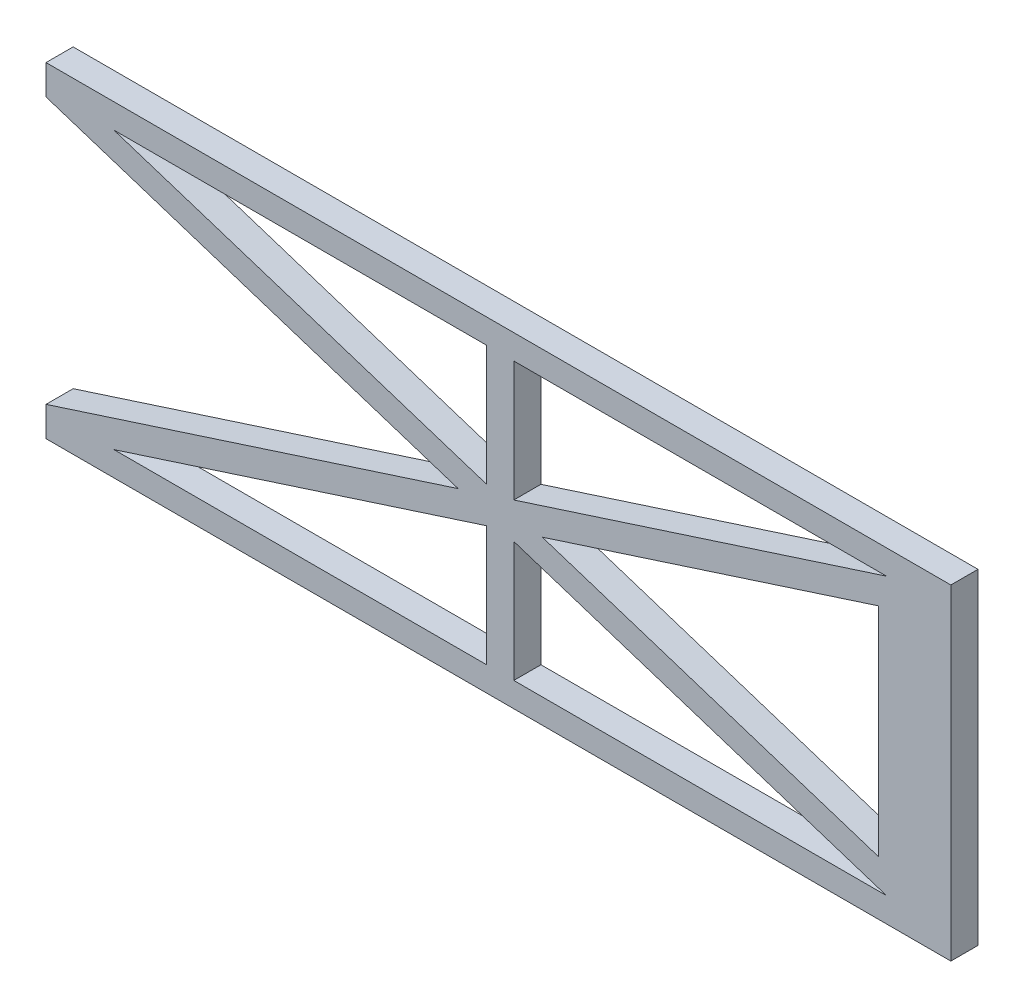
ISO-10303-21;
HEADER;
FILE_DESCRIPTION(('STEP AP214'),'2;1');
FILE_NAME('part.step','',(''),(''),'','','');
FILE_SCHEMA(('AUTOMOTIVE_DESIGN { 1 0 10303 214 1 1 1 1 }'));
ENDSEC;
DATA;
#1=APPLICATION_CONTEXT('core data for automotive mechanical design processes');
#2=APPLICATION_PROTOCOL_DEFINITION('international standard','automotive_design',2000,#1);
#3=PRODUCT_CONTEXT('',#1,'mechanical');
#4=PRODUCT('Part','Part','',(#3));
#5=PRODUCT_RELATED_PRODUCT_CATEGORY('part','',(#4));
#6=PRODUCT_DEFINITION_FORMATION('','',#4);
#7=PRODUCT_DEFINITION_CONTEXT('part definition',#1,'design');
#8=PRODUCT_DEFINITION('design','',#6,#7);
#9=PRODUCT_DEFINITION_SHAPE('','',#8);
#10=(LENGTH_UNIT() NAMED_UNIT(*) SI_UNIT(.MILLI.,.METRE.));
#11=(NAMED_UNIT(*) PLANE_ANGLE_UNIT() SI_UNIT($,.RADIAN.));
#12=(NAMED_UNIT(*) SI_UNIT($,.STERADIAN.) SOLID_ANGLE_UNIT());
#13=UNCERTAINTY_MEASURE_WITH_UNIT(LENGTH_MEASURE(1.E-05),#10,'distance_accuracy_value','');
#14=(GEOMETRIC_REPRESENTATION_CONTEXT(3) GLOBAL_UNCERTAINTY_ASSIGNED_CONTEXT((#13)) GLOBAL_UNIT_ASSIGNED_CONTEXT((#10,
#11,#12)) REPRESENTATION_CONTEXT('',''));
#15=CARTESIAN_POINT('',(0.,0.,0.));
#16=DIRECTION('',(0.,0.,1.));
#17=DIRECTION('',(1.,0.,0.));
#18=AXIS2_PLACEMENT_3D('',#15,#16,#17);
#19=CARTESIAN_POINT('',(-928.915298157078,-300.,-30.));
#20=DIRECTION('',(-0.307327428017138,0.951603831427959,0.));
#21=DIRECTION('',(-0.951603831427959,-0.307327428017138,0.));
#22=AXIS2_PLACEMENT_3D('',#19,#20,#21);
#23=PLANE('',#22);
#24=DIRECTION('',(-0.951603831427959,-0.307327428017138,0.));
#25=VECTOR('',#24,1.);
#26=CARTESIAN_POINT('',(-928.915298157078,-300.,-30.));
#27=LINE('',#26,#25);
#28=CARTESIAN_POINT('',(0.,0.,-30.));
#29=VERTEX_POINT('',#28);
#30=CARTESIAN_POINT('',(-411.927182327763,-133.034900968368,-30.));
#31=VERTEX_POINT('',#30);
#32=EDGE_CURVE('E68',#29,#31,#27,.T.);
#33=ORIENTED_EDGE('',*,*,#32,.T.);
#34=DIRECTION('',(0.,0.,1.));
#35=VECTOR('',#34,1.);
#36=CARTESIAN_POINT('',(-411.927182327763,-133.034900968368,-30.));
#37=LINE('',#36,#35);
#38=CARTESIAN_POINT('',(-411.927182327763,-133.034900968368,0.));
#39=VERTEX_POINT('',#38);
#40=EDGE_CURVE('E365',#31,#39,#37,.T.);
#41=ORIENTED_EDGE('',*,*,#40,.T.);
#42=DIRECTION('',(-0.951603831427959,-0.307327428017138,0.));
#43=VECTOR('',#42,1.);
#44=CARTESIAN_POINT('',(-928.915298157078,-300.,0.));
#45=LINE('',#44,#43);
#46=CARTESIAN_POINT('',(0.,0.,0.));
#47=VERTEX_POINT('',#46);
#48=EDGE_CURVE('E259',#47,#39,#45,.T.);
#49=ORIENTED_EDGE('',*,*,#48,.F.);
#50=DIRECTION('',(0.,0.,1.));
#51=VECTOR('',#50,1.);
#52=CARTESIAN_POINT('',(0.,0.,-30.));
#53=LINE('',#52,#51);
#54=EDGE_CURVE('E276',#29,#47,#53,.T.);
#55=ORIENTED_EDGE('',*,*,#54,.F.);
#56=EDGE_LOOP('',(#33,#41,#49,#55));
#57=FACE_BOUND('',#56,.T.);
#58=ADVANCED_FACE('F45',(#57),#23,.T.);
#59=CARTESIAN_POINT('',(0.,0.,-30.));
#60=DIRECTION('',(0.,-1.,0.));
#61=DIRECTION('',(1.,0.,0.));
#62=AXIS2_PLACEMENT_3D('',#59,#60,#61);
#63=PLANE('',#62);
#64=DIRECTION('',(1.,0.,0.));
#65=VECTOR('',#64,1.);
#66=CARTESIAN_POINT('',(0.,0.,0.));
#67=LINE('',#66,#65);
#68=CARTESIAN_POINT('',(-411.927182327763,0.,0.));
#69=VERTEX_POINT('',#68);
#70=EDGE_CURVE('E272',#69,#47,#67,.T.);
#71=ORIENTED_EDGE('',*,*,#70,.F.);
#72=DIRECTION('',(0.,0.,1.));
#73=VECTOR('',#72,1.);
#74=CARTESIAN_POINT('',(-411.927182327763,0.,0.));
#75=LINE('',#74,#73);
#76=CARTESIAN_POINT('',(-411.927182327763,0.,-30.));
#77=VERTEX_POINT('',#76);
#78=EDGE_CURVE('E373',#77,#69,#75,.T.);
#79=ORIENTED_EDGE('',*,*,#78,.F.);
#80=DIRECTION('',(1.,0.,0.));
#81=VECTOR('',#80,1.);
#82=CARTESIAN_POINT('',(0.,0.,-30.));
#83=LINE('',#82,#81);
#84=EDGE_CURVE('E256',#77,#29,#83,.T.);
#85=ORIENTED_EDGE('',*,*,#84,.T.);
#86=ORIENTED_EDGE('',*,*,#54,.T.);
#87=EDGE_LOOP('',(#71,#79,#85,#86));
#88=FACE_BOUND('',#87,.T.);
#89=ADVANCED_FACE('F413',(#88),#63,.T.);
#90=CARTESIAN_POINT('',(-853.854364655526,-1.11022302462516E-13,-30.));
#91=VERTEX_POINT('',#90);
#92=CARTESIAN_POINT('',(-441.927182327763,0.,-30.));
#93=VERTEX_POINT('',#92);
#94=EDGE_CURVE('E228',#91,#93,#83,.T.);
#95=ORIENTED_EDGE('',*,*,#94,.T.);
#96=DIRECTION('',(0.,0.,-1.));
#97=VECTOR('',#96,1.);
#98=CARTESIAN_POINT('',(-441.927182327763,0.,0.));
#99=LINE('',#98,#97);
#100=CARTESIAN_POINT('',(-441.927182327763,0.,0.));
#101=VERTEX_POINT('',#100);
#102=EDGE_CURVE('E369',#101,#93,#99,.T.);
#103=ORIENTED_EDGE('',*,*,#102,.F.);
#104=CARTESIAN_POINT('',(-853.854364655526,-1.22504029266495E-13,0.));
#105=VERTEX_POINT('',#104);
#106=EDGE_CURVE('E273',#105,#101,#67,.T.);
#107=ORIENTED_EDGE('',*,*,#106,.F.);
#108=DIRECTION('',(0.,0.,-1.));
#109=VECTOR('',#108,1.);
#110=CARTESIAN_POINT('',(-853.854364655526,-1.06230180454845E-13,-30.));
#111=LINE('',#110,#109);
#112=EDGE_CURVE('E321',#105,#91,#111,.T.);
#113=ORIENTED_EDGE('',*,*,#112,.T.);
#114=EDGE_LOOP('',(#95,#103,#107,#113));
#115=FACE_BOUND('',#114,.T.);
#116=ADVANCED_FACE('F417',(#115),#63,.T.);
#117=CARTESIAN_POINT('',(-8.91529815707796,-32.8792608458809,-30.));
#118=DIRECTION('',(0.307327428017138,-0.951603831427959,0.));
#119=DIRECTION('',(0.951603831427959,0.307327428017138,0.));
#120=AXIS2_PLACEMENT_3D('',#117,#118,#119);
#121=PLANE('',#120);
#122=DIRECTION('',(0.951603831427959,0.307327428017138,0.));
#123=VECTOR('',#122,1.);
#124=CARTESIAN_POINT('',(-8.91529815707796,-32.8792608458809,-30.));
#125=LINE('',#124,#123);
#126=CARTESIAN_POINT('',(-853.854364655526,-305.758521691762,-30.));
#127=VERTEX_POINT('',#126);
#128=CARTESIAN_POINT('',(-441.927182327763,-172.723620723394,-30.));
#129=VERTEX_POINT('',#128);
#130=EDGE_CURVE('E60',#127,#129,#125,.T.);
#131=ORIENTED_EDGE('',*,*,#130,.T.);
#132=DIRECTION('',(0.,0.,1.));
#133=VECTOR('',#132,1.);
#134=CARTESIAN_POINT('',(-441.927182327763,-172.723620723394,-30.));
#135=LINE('',#134,#133);
#136=CARTESIAN_POINT('',(-441.927182327763,-172.723620723394,0.));
#137=VERTEX_POINT('',#136);
#138=EDGE_CURVE('E367',#129,#137,#135,.T.);
#139=ORIENTED_EDGE('',*,*,#138,.T.);
#140=DIRECTION('',(0.951603831427959,0.307327428017138,0.));
#141=VECTOR('',#140,1.);
#142=CARTESIAN_POINT('',(-8.91529815707796,-32.8792608458809,0.));
#143=LINE('',#142,#141);
#144=CARTESIAN_POINT('',(-853.854364655526,-305.758521691762,0.));
#145=VERTEX_POINT('',#144);
#146=EDGE_CURVE('E215',#145,#137,#143,.T.);
#147=ORIENTED_EDGE('',*,*,#146,.F.);
#148=DIRECTION('',(0.,0.,-1.));
#149=VECTOR('',#148,1.);
#150=CARTESIAN_POINT('',(-853.854364655526,-305.758521691762,-30.));
#151=LINE('',#150,#149);
#152=EDGE_CURVE('E318',#145,#127,#151,.T.);
#153=ORIENTED_EDGE('',*,*,#152,.T.);
#154=EDGE_LOOP('',(#131,#139,#147,#153));
#155=FACE_BOUND('',#154,.T.);
#156=ADVANCED_FACE('F425',(#155),#121,.T.);
#157=CARTESIAN_POINT('',(0.,-305.758521691762,-30.));
#158=DIRECTION('',(0.,-1.,0.));
#159=DIRECTION('',(1.,0.,0.));
#160=AXIS2_PLACEMENT_3D('',#157,#158,#159);
#161=PLANE('',#160);
#162=DIRECTION('',(0.,0.,-1.));
#163=VECTOR('',#162,1.);
#164=CARTESIAN_POINT('',(-411.927182327763,-305.758521691762,0.));
#165=LINE('',#164,#163);
#166=CARTESIAN_POINT('',(-411.927182327763,-305.758521691762,0.));
#167=VERTEX_POINT('',#166);
#168=CARTESIAN_POINT('',(-411.927182327763,-305.758521691762,-30.));
#169=VERTEX_POINT('',#168);
#170=EDGE_CURVE('E387',#167,#169,#165,.T.);
#171=ORIENTED_EDGE('',*,*,#170,.F.);
#172=DIRECTION('',(1.,0.,0.));
#173=VECTOR('',#172,1.);
#174=CARTESIAN_POINT('',(0.,-305.758521691762,0.));
#175=LINE('',#174,#173);
#176=CARTESIAN_POINT('',(0.,-305.758521691762,0.));
#177=VERTEX_POINT('',#176);
#178=EDGE_CURVE('E352',#167,#177,#175,.T.);
#179=ORIENTED_EDGE('',*,*,#178,.T.);
#180=DIRECTION('',(0.,0.,1.));
#181=VECTOR('',#180,1.);
#182=CARTESIAN_POINT('',(0.,-305.758521691762,-30.));
#183=LINE('',#182,#181);
#184=CARTESIAN_POINT('',(0.,-305.758521691762,-30.));
#185=VERTEX_POINT('',#184);
#186=EDGE_CURVE('E311',#185,#177,#183,.T.);
#187=ORIENTED_EDGE('',*,*,#186,.F.);
#188=DIRECTION('',(1.,0.,0.));
#189=VECTOR('',#188,1.);
#190=CARTESIAN_POINT('',(0.,-305.758521691762,-30.));
#191=LINE('',#190,#189);
#192=EDGE_CURVE('E346',#169,#185,#191,.T.);
#193=ORIENTED_EDGE('',*,*,#192,.F.);
#194=EDGE_LOOP('',(#171,#179,#187,#193));
#195=FACE_BOUND('',#194,.T.);
#196=ADVANCED_FACE('F432',(#195),#161,.F.);
#197=DIRECTION('',(0.,0.,1.));
#198=VECTOR('',#197,1.);
#199=CARTESIAN_POINT('',(-441.927182327763,-305.758521691762,0.));
#200=LINE('',#199,#198);
#201=CARTESIAN_POINT('',(-441.927182327763,-305.758521691762,-30.));
#202=VERTEX_POINT('',#201);
#203=CARTESIAN_POINT('',(-441.927182327763,-305.758521691762,0.));
#204=VERTEX_POINT('',#203);
#205=EDGE_CURVE('E390',#202,#204,#200,.T.);
#206=ORIENTED_EDGE('',*,*,#205,.F.);
#207=EDGE_CURVE('E342',#127,#202,#191,.T.);
#208=ORIENTED_EDGE('',*,*,#207,.F.);
#209=ORIENTED_EDGE('',*,*,#152,.F.);
#210=EDGE_CURVE('E353',#145,#204,#175,.T.);
#211=ORIENTED_EDGE('',*,*,#210,.T.);
#212=EDGE_LOOP('',(#206,#208,#209,#211));
#213=FACE_BOUND('',#212,.T.);
#214=ADVANCED_FACE('F437',(#213),#161,.F.);
#215=CARTESIAN_POINT('',(-928.915298157078,-5.75852169176161,-30.));
#216=DIRECTION('',(0.307327428017138,0.951603831427959,0.));
#217=DIRECTION('',(-0.951603831427959,0.307327428017138,0.));
#218=AXIS2_PLACEMENT_3D('',#215,#216,#217);
#219=PLANE('',#218);
#220=DIRECTION('',(0.,0.,1.));
#221=VECTOR('',#220,1.);
#222=CARTESIAN_POINT('',(-411.927182327763,-172.723620723394,-30.));
#223=LINE('',#222,#221);
#224=CARTESIAN_POINT('',(-411.927182327763,-172.723620723394,-30.));
#225=VERTEX_POINT('',#224);
#226=CARTESIAN_POINT('',(-411.927182327763,-172.723620723394,0.));
#227=VERTEX_POINT('',#226);
#228=EDGE_CURVE('E12',#225,#227,#223,.T.);
#229=ORIENTED_EDGE('',*,*,#228,.F.);
#230=DIRECTION('',(-0.951603831427959,0.307327428017138,0.));
#231=VECTOR('',#230,1.);
#232=CARTESIAN_POINT('',(-928.915298157078,-5.75852169176161,-30.));
#233=LINE('',#232,#231);
#234=EDGE_CURVE('E362',#185,#225,#233,.T.);
#235=ORIENTED_EDGE('',*,*,#234,.F.);
#236=ORIENTED_EDGE('',*,*,#186,.T.);
#237=DIRECTION('',(-0.951603831427959,0.307327428017138,0.));
#238=VECTOR('',#237,1.);
#239=CARTESIAN_POINT('',(-928.915298157078,-5.75852169176161,0.));
#240=LINE('',#239,#238);
#241=EDGE_CURVE('E350',#177,#227,#240,.T.);
#242=ORIENTED_EDGE('',*,*,#241,.T.);
#243=EDGE_LOOP('',(#229,#235,#236,#242));
#244=FACE_BOUND('',#243,.T.);
#245=ADVANCED_FACE('F408',(#244),#219,.F.);
#246=CARTESIAN_POINT('',(-8.91529815707796,-272.879260845881,-30.));
#247=DIRECTION('',(-0.307327428017138,-0.951603831427959,0.));
#248=DIRECTION('',(0.951603831427959,-0.307327428017138,0.));
#249=AXIS2_PLACEMENT_3D('',#246,#247,#248);
#250=PLANE('',#249);
#251=DIRECTION('',(0.,0.,1.));
#252=VECTOR('',#251,1.);
#253=CARTESIAN_POINT('',(-441.927182327763,-133.034900968368,-30.));
#254=LINE('',#253,#252);
#255=CARTESIAN_POINT('',(-441.927182327763,-133.034900968368,-30.));
#256=VERTEX_POINT('',#255);
#257=CARTESIAN_POINT('',(-441.927182327763,-133.034900968368,0.));
#258=VERTEX_POINT('',#257);
#259=EDGE_CURVE('E53',#256,#258,#254,.T.);
#260=ORIENTED_EDGE('',*,*,#259,.F.);
#261=DIRECTION('',(0.951603831427959,-0.307327428017138,0.));
#262=VECTOR('',#261,1.);
#263=CARTESIAN_POINT('',(-8.91529815707796,-272.879260845881,-30.));
#264=LINE('',#263,#262);
#265=EDGE_CURVE('E317',#91,#256,#264,.T.);
#266=ORIENTED_EDGE('',*,*,#265,.F.);
#267=ORIENTED_EDGE('',*,*,#112,.F.);
#268=DIRECTION('',(0.951603831427959,-0.307327428017138,0.));
#269=VECTOR('',#268,1.);
#270=CARTESIAN_POINT('',(-8.91529815707796,-272.879260845881,0.));
#271=LINE('',#270,#269);
#272=EDGE_CURVE('E356',#105,#258,#271,.T.);
#273=ORIENTED_EDGE('',*,*,#272,.T.);
#274=EDGE_LOOP('',(#260,#266,#267,#273));
#275=FACE_BOUND('',#274,.T.);
#276=ADVANCED_FACE('F400',(#275),#250,.F.);
#277=CARTESIAN_POINT('',(-473.372947235617,-152.879260845881,0.));
#278=VERTEX_POINT('',#277);
#279=CARTESIAN_POINT('',(-928.915298157078,-300.,0.));
#280=VERTEX_POINT('',#279);
#281=EDGE_CURVE('E262',#278,#280,#45,.T.);
#282=ORIENTED_EDGE('',*,*,#281,.F.);
#283=DIRECTION('',(0.,0.,-1.));
#284=VECTOR('',#283,1.);
#285=CARTESIAN_POINT('',(-473.372947235617,-152.879260845881,-30.));
#286=LINE('',#285,#284);
#287=CARTESIAN_POINT('',(-473.372947235617,-152.879260845881,-30.));
#288=VERTEX_POINT('',#287);
#289=EDGE_CURVE('E242',#278,#288,#286,.T.);
#290=ORIENTED_EDGE('',*,*,#289,.T.);
#291=CARTESIAN_POINT('',(-928.915298157078,-300.,-30.));
#292=VERTEX_POINT('',#291);
#293=EDGE_CURVE('E241',#288,#292,#27,.T.);
#294=ORIENTED_EDGE('',*,*,#293,.T.);
#295=DIRECTION('',(0.,0.,1.));
#296=VECTOR('',#295,1.);
#297=CARTESIAN_POINT('',(-928.915298157078,-300.,-30.));
#298=LINE('',#297,#296);
#299=EDGE_CURVE('E223',#292,#280,#298,.T.);
#300=ORIENTED_EDGE('',*,*,#299,.T.);
#301=EDGE_LOOP('',(#282,#290,#294,#300));
#302=FACE_BOUND('',#301,.T.);
#303=ADVANCED_FACE('F47',(#302),#23,.T.);
#304=CARTESIAN_POINT('',(-380.481417419909,-152.879260845881,0.));
#305=VERTEX_POINT('',#304);
#306=CARTESIAN_POINT('',(-8.91529815707792,-32.8792608458809,0.));
#307=VERTEX_POINT('',#306);
#308=EDGE_CURVE('E209',#305,#307,#143,.T.);
#309=ORIENTED_EDGE('',*,*,#308,.F.);
#310=DIRECTION('',(0.,0.,-1.));
#311=VECTOR('',#310,1.);
#312=CARTESIAN_POINT('',(-380.481417419909,-152.879260845881,-30.));
#313=LINE('',#312,#311);
#314=CARTESIAN_POINT('',(-380.481417419909,-152.879260845881,-30.));
#315=VERTEX_POINT('',#314);
#316=EDGE_CURVE('E320',#305,#315,#313,.T.);
#317=ORIENTED_EDGE('',*,*,#316,.T.);
#318=CARTESIAN_POINT('',(-8.91529815707792,-32.8792608458809,-30.));
#319=VERTEX_POINT('',#318);
#320=EDGE_CURVE('E221',#315,#319,#125,.T.);
#321=ORIENTED_EDGE('',*,*,#320,.T.);
#322=DIRECTION('',(0.,0.,1.));
#323=VECTOR('',#322,1.);
#324=CARTESIAN_POINT('',(-8.91529815707796,-32.8792608458809,-30.));
#325=LINE('',#324,#323);
#326=EDGE_CURVE('E201',#319,#307,#325,.T.);
#327=ORIENTED_EDGE('',*,*,#326,.T.);
#328=EDGE_LOOP('',(#309,#317,#321,#327));
#329=FACE_BOUND('',#328,.T.);
#330=ADVANCED_FACE('F219',(#329),#121,.T.);
#331=CARTESIAN_POINT('',(-928.915298157078,-1.15568700981347E-13,-30.));
#332=DIRECTION('',(-1.,0.,0.));
#333=DIRECTION('',(0.,0.,1.));
#334=AXIS2_PLACEMENT_3D('',#331,#332,#333);
#335=PLANE('',#334);
#336=DIRECTION('',(0.,0.,1.));
#337=VECTOR('',#336,1.);
#338=CARTESIAN_POINT('',(-928.915298157078,-5.75852169176161,-30.));
#339=LINE('',#338,#337);
#340=CARTESIAN_POINT('',(-928.915298157078,-5.75852169176161,-30.));
#341=VERTEX_POINT('',#340);
#342=CARTESIAN_POINT('',(-928.915298157078,-5.75852169176161,0.));
#343=VERTEX_POINT('',#342);
#344=EDGE_CURVE('E289',#341,#343,#339,.T.);
#345=ORIENTED_EDGE('',*,*,#344,.T.);
#346=DIRECTION('',(0.,-1.,0.));
#347=VECTOR('',#346,1.);
#348=CARTESIAN_POINT('',(-928.915298157078,-1.15568700981347E-13,0.));
#349=LINE('',#348,#347);
#350=CARTESIAN_POINT('',(-928.915298157078,27.1207391541191,0.));
#351=VERTEX_POINT('',#350);
#352=EDGE_CURVE('E270',#351,#343,#349,.T.);
#353=ORIENTED_EDGE('',*,*,#352,.F.);
#354=DIRECTION('',(0.,0.,1.));
#355=VECTOR('',#354,1.);
#356=CARTESIAN_POINT('',(-928.915298157078,27.1207391541191,-30.));
#357=LINE('',#356,#355);
#358=CARTESIAN_POINT('',(-928.915298157078,27.1207391541191,-30.));
#359=VERTEX_POINT('',#358);
#360=EDGE_CURVE('E225',#359,#351,#357,.T.);
#361=ORIENTED_EDGE('',*,*,#360,.F.);
#362=DIRECTION('',(0.,-1.,0.));
#363=VECTOR('',#362,1.);
#364=CARTESIAN_POINT('',(-928.915298157078,-1.15568700981347E-13,-30.));
#365=LINE('',#364,#363);
#366=EDGE_CURVE('E253',#359,#341,#365,.T.);
#367=ORIENTED_EDGE('',*,*,#366,.T.);
#368=EDGE_LOOP('',(#345,#353,#361,#367));
#369=FACE_BOUND('',#368,.T.);
#370=ADVANCED_FACE('F287',(#369),#335,.T.);
#371=CARTESIAN_POINT('',(-928.915298157078,27.1207391541191,-30.));
#372=DIRECTION('',(0.,1.,0.));
#373=DIRECTION('',(-1.,0.,0.));
#374=AXIS2_PLACEMENT_3D('',#371,#372,#373);
#375=PLANE('',#374);
#376=DIRECTION('',(-1.,0.,0.));
#377=VECTOR('',#376,1.);
#378=CARTESIAN_POINT('',(-928.915298157078,27.1207391541191,0.));
#379=LINE('',#378,#377);
#380=CARTESIAN_POINT('',(71.084701842922,27.1207391541191,0.));
#381=VERTEX_POINT('',#380);
#382=EDGE_CURVE('E266',#381,#351,#379,.T.);
#383=ORIENTED_EDGE('',*,*,#382,.F.);
#384=DIRECTION('',(0.,0.,1.));
#385=VECTOR('',#384,1.);
#386=CARTESIAN_POINT('',(71.084701842922,27.1207391541191,-30.));
#387=LINE('',#386,#385);
#388=CARTESIAN_POINT('',(71.084701842922,27.1207391541191,-30.));
#389=VERTEX_POINT('',#388);
#390=EDGE_CURVE('E222',#389,#381,#387,.T.);
#391=ORIENTED_EDGE('',*,*,#390,.F.);
#392=DIRECTION('',(-1.,0.,0.));
#393=VECTOR('',#392,1.);
#394=CARTESIAN_POINT('',(-928.915298157078,27.1207391541191,-30.));
#395=LINE('',#394,#393);
#396=EDGE_CURVE('E249',#389,#359,#395,.T.);
#397=ORIENTED_EDGE('',*,*,#396,.T.);
#398=ORIENTED_EDGE('',*,*,#360,.T.);
#399=EDGE_LOOP('',(#383,#391,#397,#398));
#400=FACE_BOUND('',#399,.T.);
#401=ADVANCED_FACE('F282',(#400),#375,.T.);
#402=CARTESIAN_POINT('',(71.084701842922,27.1207391541191,-30.));
#403=DIRECTION('',(1.,0.,0.));
#404=DIRECTION('',(0.,1.,0.));
#405=AXIS2_PLACEMENT_3D('',#402,#403,#404);
#406=PLANE('',#405);
#407=DIRECTION('',(0.,1.,0.));
#408=VECTOR('',#407,1.);
#409=CARTESIAN_POINT('',(71.084701842922,27.1207391541191,0.));
#410=LINE('',#409,#408);
#411=CARTESIAN_POINT('',(71.084701842922,-332.879260845881,0.));
#412=VERTEX_POINT('',#411);
#413=EDGE_CURVE('E264',#412,#381,#410,.T.);
#414=ORIENTED_EDGE('',*,*,#413,.F.);
#415=DIRECTION('',(0.,0.,1.));
#416=VECTOR('',#415,1.);
#417=CARTESIAN_POINT('',(71.084701842922,-332.879260845881,-30.));
#418=LINE('',#417,#416);
#419=CARTESIAN_POINT('',(71.084701842922,-332.879260845881,-30.));
#420=VERTEX_POINT('',#419);
#421=EDGE_CURVE('E300',#420,#412,#418,.T.);
#422=ORIENTED_EDGE('',*,*,#421,.F.);
#423=DIRECTION('',(0.,1.,0.));
#424=VECTOR('',#423,1.);
#425=CARTESIAN_POINT('',(71.084701842922,27.1207391541191,-30.));
#426=LINE('',#425,#424);
#427=EDGE_CURVE('E246',#420,#389,#426,.T.);
#428=ORIENTED_EDGE('',*,*,#427,.T.);
#429=ORIENTED_EDGE('',*,*,#390,.T.);
#430=EDGE_LOOP('',(#414,#422,#428,#429));
#431=FACE_BOUND('',#430,.T.);
#432=ADVANCED_FACE('F299',(#431),#406,.T.);
#433=CARTESIAN_POINT('',(-928.915298157078,-330.,-30.));
#434=DIRECTION('',(-1.,0.,0.));
#435=DIRECTION('',(0.,-1.,0.));
#436=AXIS2_PLACEMENT_3D('',#433,#434,#435);
#437=PLANE('',#436);
#438=DIRECTION('',(0.,0.,1.));
#439=VECTOR('',#438,1.);
#440=CARTESIAN_POINT('',(-928.915298157078,-332.879260845881,-30.));
#441=LINE('',#440,#439);
#442=CARTESIAN_POINT('',(-928.915298157078,-332.879260845881,-30.));
#443=VERTEX_POINT('',#442);
#444=CARTESIAN_POINT('',(-928.915298157078,-332.879260845881,0.));
#445=VERTEX_POINT('',#444);
#446=EDGE_CURVE('E308',#443,#445,#441,.T.);
#447=ORIENTED_EDGE('',*,*,#446,.T.);
#448=DIRECTION('',(0.,-1.,0.));
#449=VECTOR('',#448,1.);
#450=CARTESIAN_POINT('',(-928.915298157078,-330.,0.));
#451=LINE('',#450,#449);
#452=EDGE_CURVE('E216',#280,#445,#451,.T.);
#453=ORIENTED_EDGE('',*,*,#452,.F.);
#454=ORIENTED_EDGE('',*,*,#299,.F.);
#455=DIRECTION('',(0.,-1.,0.));
#456=VECTOR('',#455,1.);
#457=CARTESIAN_POINT('',(-928.915298157078,-330.,-30.));
#458=LINE('',#457,#456);
#459=EDGE_CURVE('E240',#292,#443,#458,.T.);
#460=ORIENTED_EDGE('',*,*,#459,.T.);
#461=EDGE_LOOP('',(#447,#453,#454,#460));
#462=FACE_BOUND('',#461,.T.);
#463=ADVANCED_FACE('F337',(#462),#437,.T.);
#464=CARTESIAN_POINT('',(0.,0.,-30.));
#465=DIRECTION('',(0.,0.,1.));
#466=DIRECTION('',(1.,0.,0.));
#467=AXIS2_PLACEMENT_3D('',#464,#465,#466);
#468=PLANE('',#467);
#469=ORIENTED_EDGE('',*,*,#427,.F.);
#470=DIRECTION('',(-1.,0.,0.));
#471=VECTOR('',#470,1.);
#472=CARTESIAN_POINT('',(-928.915298157078,-332.879260845881,-30.));
#473=LINE('',#472,#471);
#474=EDGE_CURVE('E307',#420,#443,#473,.T.);
#475=ORIENTED_EDGE('',*,*,#474,.T.);
#476=ORIENTED_EDGE('',*,*,#459,.F.);
#477=ORIENTED_EDGE('',*,*,#293,.F.);
#478=EDGE_CURVE('E358',#288,#341,#233,.T.);
#479=ORIENTED_EDGE('',*,*,#478,.T.);
#480=ORIENTED_EDGE('',*,*,#366,.F.);
#481=ORIENTED_EDGE('',*,*,#396,.F.);
#482=EDGE_LOOP('',(#469,#475,#476,#477,#479,#480,#481));
#483=FACE_BOUND('',#482,.T.);
#484=DIRECTION('',(0.,-1.,0.));
#485=VECTOR('',#484,1.);
#486=CARTESIAN_POINT('',(-411.927182327763,42.4264068711929,-30.));
#487=LINE('',#486,#485);
#488=EDGE_CURVE('E379',#77,#31,#487,.T.);
#489=ORIENTED_EDGE('',*,*,#488,.T.);
#490=ORIENTED_EDGE('',*,*,#32,.F.);
#491=ORIENTED_EDGE('',*,*,#84,.F.);
#492=EDGE_LOOP('',(#489,#490,#491));
#493=FACE_BOUND('',#492,.T.);
#494=DIRECTION('',(0.,-1.,0.));
#495=VECTOR('',#494,1.);
#496=CARTESIAN_POINT('',(-441.927182327763,42.4264068711929,-30.));
#497=LINE('',#496,#495);
#498=EDGE_CURVE('E386',#129,#202,#497,.T.);
#499=ORIENTED_EDGE('',*,*,#498,.F.);
#500=ORIENTED_EDGE('',*,*,#130,.F.);
#501=ORIENTED_EDGE('',*,*,#207,.T.);
#502=EDGE_LOOP('',(#499,#500,#501));
#503=FACE_BOUND('',#502,.T.);
#504=ORIENTED_EDGE('',*,*,#234,.T.);
#505=EDGE_CURVE('E382',#225,#169,#487,.T.);
#506=ORIENTED_EDGE('',*,*,#505,.T.);
#507=ORIENTED_EDGE('',*,*,#192,.T.);
#508=EDGE_LOOP('',(#504,#506,#507));
#509=FACE_BOUND('',#508,.T.);
#510=ORIENTED_EDGE('',*,*,#265,.T.);
#511=EDGE_CURVE('E383',#93,#256,#497,.T.);
#512=ORIENTED_EDGE('',*,*,#511,.F.);
#513=ORIENTED_EDGE('',*,*,#94,.F.);
#514=EDGE_LOOP('',(#510,#512,#513));
#515=FACE_BOUND('',#514,.T.);
#516=DIRECTION('',(0.,-1.,0.));
#517=VECTOR('',#516,1.);
#518=CARTESIAN_POINT('',(-8.91529815707791,27.122739154119,-30.));
#519=LINE('',#518,#517);
#520=CARTESIAN_POINT('',(-8.91529815707796,-272.879260845881,-30.));
#521=VERTEX_POINT('',#520);
#522=EDGE_CURVE('E206',#319,#521,#519,.T.);
#523=ORIENTED_EDGE('',*,*,#522,.F.);
#524=ORIENTED_EDGE('',*,*,#320,.F.);
#525=EDGE_CURVE('E341',#315,#521,#264,.T.);
#526=ORIENTED_EDGE('',*,*,#525,.T.);
#527=EDGE_LOOP('',(#523,#524,#526));
#528=FACE_BOUND('',#527,.T.);
#529=ADVANCED_FACE('F339',(#483,#493,#503,#509,#515,#528),#468,.F.);
#530=CARTESIAN_POINT('',(0.,0.,0.));
#531=DIRECTION('',(0.,0.,1.));
#532=DIRECTION('',(1.,0.,0.));
#533=AXIS2_PLACEMENT_3D('',#530,#531,#532);
#534=PLANE('',#533);
#535=DIRECTION('',(-1.,0.,0.));
#536=VECTOR('',#535,1.);
#537=CARTESIAN_POINT('',(-928.915298157078,-332.879260845881,0.));
#538=LINE('',#537,#536);
#539=EDGE_CURVE('E295',#412,#445,#538,.T.);
#540=ORIENTED_EDGE('',*,*,#539,.F.);
#541=ORIENTED_EDGE('',*,*,#413,.T.);
#542=ORIENTED_EDGE('',*,*,#382,.T.);
#543=ORIENTED_EDGE('',*,*,#352,.T.);
#544=EDGE_CURVE('E333',#278,#343,#240,.T.);
#545=ORIENTED_EDGE('',*,*,#544,.F.);
#546=ORIENTED_EDGE('',*,*,#281,.T.);
#547=ORIENTED_EDGE('',*,*,#452,.T.);
#548=EDGE_LOOP('',(#540,#541,#542,#543,#545,#546,#547));
#549=FACE_BOUND('',#548,.T.);
#550=DIRECTION('',(0.,-1.,0.));
#551=VECTOR('',#550,1.);
#552=CARTESIAN_POINT('',(-411.927182327763,42.4264068711929,0.));
#553=LINE('',#552,#551);
#554=EDGE_CURVE('E378',#227,#167,#553,.T.);
#555=ORIENTED_EDGE('',*,*,#554,.F.);
#556=ORIENTED_EDGE('',*,*,#241,.F.);
#557=ORIENTED_EDGE('',*,*,#178,.F.);
#558=EDGE_LOOP('',(#555,#556,#557));
#559=FACE_BOUND('',#558,.T.);
#560=DIRECTION('',(0.,-1.,0.));
#561=VECTOR('',#560,1.);
#562=CARTESIAN_POINT('',(-441.927182327763,42.4264068711929,0.));
#563=LINE('',#562,#561);
#564=EDGE_CURVE('E370',#101,#258,#563,.T.);
#565=ORIENTED_EDGE('',*,*,#564,.T.);
#566=ORIENTED_EDGE('',*,*,#272,.F.);
#567=ORIENTED_EDGE('',*,*,#106,.T.);
#568=EDGE_LOOP('',(#565,#566,#567));
#569=FACE_BOUND('',#568,.T.);
#570=ORIENTED_EDGE('',*,*,#146,.T.);
#571=EDGE_CURVE('E374',#137,#204,#563,.T.);
#572=ORIENTED_EDGE('',*,*,#571,.T.);
#573=ORIENTED_EDGE('',*,*,#210,.F.);
#574=EDGE_LOOP('',(#570,#572,#573));
#575=FACE_BOUND('',#574,.T.);
#576=ORIENTED_EDGE('',*,*,#48,.T.);
#577=EDGE_CURVE('E375',#69,#39,#553,.T.);
#578=ORIENTED_EDGE('',*,*,#577,.F.);
#579=ORIENTED_EDGE('',*,*,#70,.T.);
#580=EDGE_LOOP('',(#576,#578,#579));
#581=FACE_BOUND('',#580,.T.);
#582=ORIENTED_EDGE('',*,*,#308,.T.);
#583=DIRECTION('',(0.,-1.,0.));
#584=VECTOR('',#583,1.);
#585=CARTESIAN_POINT('',(-8.91529815707791,27.122739154119,0.));
#586=LINE('',#585,#584);
#587=CARTESIAN_POINT('',(-8.91529815707796,-272.879260845881,0.));
#588=VERTEX_POINT('',#587);
#589=EDGE_CURVE('E196',#307,#588,#586,.T.);
#590=ORIENTED_EDGE('',*,*,#589,.T.);
#591=EDGE_CURVE('E211',#305,#588,#271,.T.);
#592=ORIENTED_EDGE('',*,*,#591,.F.);
#593=EDGE_LOOP('',(#582,#590,#592));
#594=FACE_BOUND('',#593,.T.);
#595=ADVANCED_FACE('F210',(#549,#559,#569,#575,#581,#594),#534,.T.);
#596=CARTESIAN_POINT('',(-928.915298157078,-332.879260845881,-30.));
#597=DIRECTION('',(0.,1.,0.));
#598=DIRECTION('',(-1.,0.,0.));
#599=AXIS2_PLACEMENT_3D('',#596,#597,#598);
#600=PLANE('',#599);
#601=ORIENTED_EDGE('',*,*,#539,.T.);
#602=ORIENTED_EDGE('',*,*,#446,.F.);
#603=ORIENTED_EDGE('',*,*,#474,.F.);
#604=ORIENTED_EDGE('',*,*,#421,.T.);
#605=EDGE_LOOP('',(#601,#602,#603,#604));
#606=FACE_BOUND('',#605,.T.);
#607=ADVANCED_FACE('F303',(#606),#600,.F.);
#608=ORIENTED_EDGE('',*,*,#316,.F.);
#609=ORIENTED_EDGE('',*,*,#591,.T.);
#610=DIRECTION('',(0.,0.,1.));
#611=VECTOR('',#610,1.);
#612=CARTESIAN_POINT('',(-8.91529815707796,-272.879260845881,-30.));
#613=LINE('',#612,#611);
#614=EDGE_CURVE('E204',#521,#588,#613,.T.);
#615=ORIENTED_EDGE('',*,*,#614,.F.);
#616=ORIENTED_EDGE('',*,*,#525,.F.);
#617=EDGE_LOOP('',(#608,#609,#615,#616));
#618=FACE_BOUND('',#617,.T.);
#619=ADVANCED_FACE('F396',(#618),#250,.F.);
#620=ORIENTED_EDGE('',*,*,#289,.F.);
#621=ORIENTED_EDGE('',*,*,#544,.T.);
#622=ORIENTED_EDGE('',*,*,#344,.F.);
#623=ORIENTED_EDGE('',*,*,#478,.F.);
#624=EDGE_LOOP('',(#620,#621,#622,#623));
#625=FACE_BOUND('',#624,.T.);
#626=ADVANCED_FACE('F398',(#625),#219,.F.);
#627=CARTESIAN_POINT('',(-411.927182327763,42.4264068711929,0.));
#628=DIRECTION('',(-1.,0.,0.));
#629=DIRECTION('',(0.,-1.,0.));
#630=AXIS2_PLACEMENT_3D('',#627,#628,#629);
#631=PLANE('',#630);
#632=ORIENTED_EDGE('',*,*,#40,.F.);
#633=ORIENTED_EDGE('',*,*,#488,.F.);
#634=ORIENTED_EDGE('',*,*,#78,.T.);
#635=ORIENTED_EDGE('',*,*,#577,.T.);
#636=EDGE_LOOP('',(#632,#633,#634,#635));
#637=FACE_BOUND('',#636,.T.);
#638=ADVANCED_FACE('F405',(#637),#631,.F.);
#639=CARTESIAN_POINT('',(-441.927182327763,42.4264068711929,0.));
#640=DIRECTION('',(1.,0.,0.));
#641=DIRECTION('',(0.,1.,0.));
#642=AXIS2_PLACEMENT_3D('',#639,#640,#641);
#643=PLANE('',#642);
#644=ORIENTED_EDGE('',*,*,#511,.T.);
#645=ORIENTED_EDGE('',*,*,#259,.T.);
#646=ORIENTED_EDGE('',*,*,#564,.F.);
#647=ORIENTED_EDGE('',*,*,#102,.T.);
#648=EDGE_LOOP('',(#644,#645,#646,#647));
#649=FACE_BOUND('',#648,.T.);
#650=ADVANCED_FACE('F494',(#649),#643,.F.);
#651=ORIENTED_EDGE('',*,*,#505,.F.);
#652=ORIENTED_EDGE('',*,*,#228,.T.);
#653=ORIENTED_EDGE('',*,*,#554,.T.);
#654=ORIENTED_EDGE('',*,*,#170,.T.);
#655=EDGE_LOOP('',(#651,#652,#653,#654));
#656=FACE_BOUND('',#655,.T.);
#657=ADVANCED_FACE('F472',(#656),#631,.F.);
#658=ORIENTED_EDGE('',*,*,#138,.F.);
#659=ORIENTED_EDGE('',*,*,#498,.T.);
#660=ORIENTED_EDGE('',*,*,#205,.T.);
#661=ORIENTED_EDGE('',*,*,#571,.F.);
#662=EDGE_LOOP('',(#658,#659,#660,#661));
#663=FACE_BOUND('',#662,.T.);
#664=ADVANCED_FACE('F491',(#663),#643,.F.);
#665=CARTESIAN_POINT('',(-8.91529815707791,27.122739154119,-30.));
#666=DIRECTION('',(1.,0.,0.));
#667=DIRECTION('',(0.,1.,0.));
#668=AXIS2_PLACEMENT_3D('',#665,#666,#667);
#669=PLANE('',#668);
#670=ORIENTED_EDGE('',*,*,#589,.F.);
#671=ORIENTED_EDGE('',*,*,#326,.F.);
#672=ORIENTED_EDGE('',*,*,#522,.T.);
#673=ORIENTED_EDGE('',*,*,#614,.T.);
#674=EDGE_LOOP('',(#670,#671,#672,#673));
#675=FACE_BOUND('',#674,.T.);
#676=ADVANCED_FACE('F198',(#675),#669,.F.);
#677=CLOSED_SHELL('',(#58,#89,#116,#156,#196,#214,#245,#276,#303,#330,#370,#401,#432,#463,#529,
#595,#607,#619,#626,#638,#650,#657,#664,#676));
#678=MANIFOLD_SOLID_BREP('B2',#677);
#679=ADVANCED_BREP_SHAPE_REPRESENTATION('',(#18,#678),#14);
#680=SHAPE_DEFINITION_REPRESENTATION(#9,#679);
ENDSEC;
END-ISO-10303-21;
